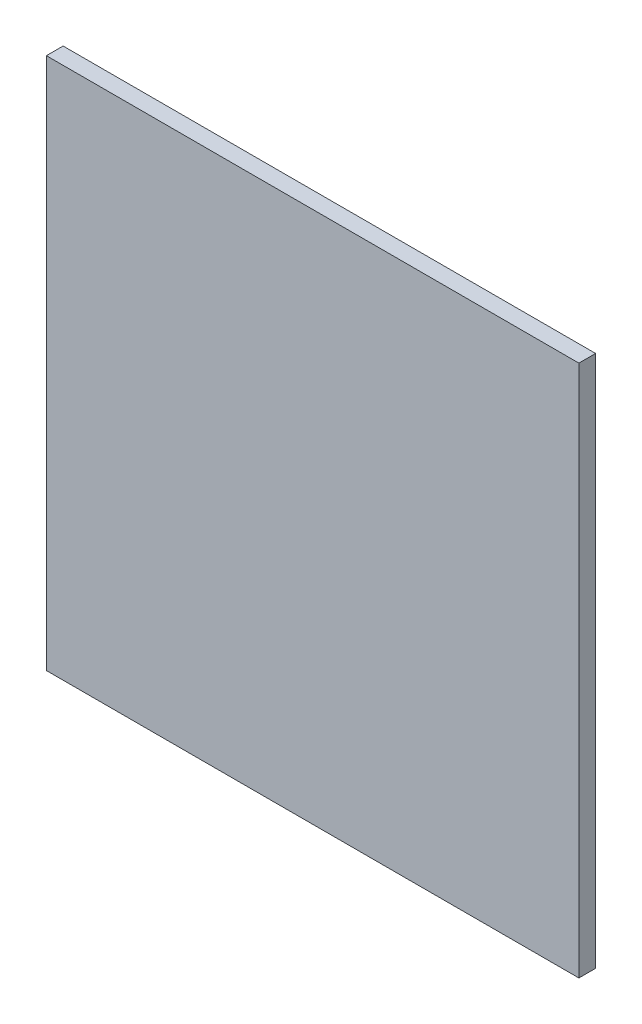
ISO-10303-21;
HEADER;
FILE_DESCRIPTION(('STEP AP214'),'2;1');
FILE_NAME('part.step','',(''),(''),'','','');
FILE_SCHEMA(('AUTOMOTIVE_DESIGN { 1 0 10303 214 1 1 1 1 }'));
ENDSEC;
DATA;
#1=APPLICATION_CONTEXT('core data for automotive mechanical design processes');
#2=APPLICATION_PROTOCOL_DEFINITION('international standard','automotive_design',2000,#1);
#3=PRODUCT_CONTEXT('',#1,'mechanical');
#4=PRODUCT('Part','Part','',(#3));
#5=PRODUCT_RELATED_PRODUCT_CATEGORY('part','',(#4));
#6=PRODUCT_DEFINITION_FORMATION('','',#4);
#7=PRODUCT_DEFINITION_CONTEXT('part definition',#1,'design');
#8=PRODUCT_DEFINITION('design','',#6,#7);
#9=PRODUCT_DEFINITION_SHAPE('','',#8);
#10=(LENGTH_UNIT() NAMED_UNIT(*) SI_UNIT(.MILLI.,.METRE.));
#11=(NAMED_UNIT(*) PLANE_ANGLE_UNIT() SI_UNIT($,.RADIAN.));
#12=(NAMED_UNIT(*) SI_UNIT($,.STERADIAN.) SOLID_ANGLE_UNIT());
#13=UNCERTAINTY_MEASURE_WITH_UNIT(LENGTH_MEASURE(1.E-05),#10,'distance_accuracy_value','');
#14=(GEOMETRIC_REPRESENTATION_CONTEXT(3) GLOBAL_UNCERTAINTY_ASSIGNED_CONTEXT((#13)) GLOBAL_UNIT_ASSIGNED_CONTEXT((#10,
#11,#12)) REPRESENTATION_CONTEXT('',''));
#15=CARTESIAN_POINT('',(0.,0.,0.));
#16=DIRECTION('',(0.,0.,1.));
#17=DIRECTION('',(1.,0.,0.));
#18=AXIS2_PLACEMENT_3D('',#15,#16,#17);
#19=CARTESIAN_POINT('',(17.5,-17.5,1.1));
#20=DIRECTION('',(-1.,0.,0.));
#21=DIRECTION('',(0.,0.,1.));
#22=AXIS2_PLACEMENT_3D('',#19,#20,#21);
#23=PLANE('',#22);
#24=DIRECTION('',(0.,1.,0.));
#25=VECTOR('',#24,1.);
#26=CARTESIAN_POINT('',(17.5,-17.5,0.));
#27=LINE('',#26,#25);
#28=CARTESIAN_POINT('',(17.5,-17.5,0.));
#29=VERTEX_POINT('',#28);
#30=CARTESIAN_POINT('',(17.5,17.5,0.));
#31=VERTEX_POINT('',#30);
#32=EDGE_CURVE('E109',#29,#31,#27,.T.);
#33=ORIENTED_EDGE('',*,*,#32,.T.);
#34=DIRECTION('',(0.,0.,-1.));
#35=VECTOR('',#34,1.);
#36=CARTESIAN_POINT('',(17.5,17.5,1.1));
#37=LINE('',#36,#35);
#38=CARTESIAN_POINT('',(17.5,17.5,1.1));
#39=VERTEX_POINT('',#38);
#40=EDGE_CURVE('E11',#39,#31,#37,.T.);
#41=ORIENTED_EDGE('',*,*,#40,.F.);
#42=DIRECTION('',(0.,1.,0.));
#43=VECTOR('',#42,1.);
#44=CARTESIAN_POINT('',(17.5,-17.5,1.1));
#45=LINE('',#44,#43);
#46=CARTESIAN_POINT('',(17.5,-17.5,1.1));
#47=VERTEX_POINT('',#46);
#48=EDGE_CURVE('E91',#47,#39,#45,.T.);
#49=ORIENTED_EDGE('',*,*,#48,.F.);
#50=DIRECTION('',(0.,0.,-1.));
#51=VECTOR('',#50,1.);
#52=CARTESIAN_POINT('',(17.5,-17.5,1.1));
#53=LINE('',#52,#51);
#54=EDGE_CURVE('E105',#47,#29,#53,.T.);
#55=ORIENTED_EDGE('',*,*,#54,.T.);
#56=EDGE_LOOP('',(#33,#41,#49,#55));
#57=FACE_BOUND('',#56,.T.);
#58=ADVANCED_FACE('F39',(#57),#23,.F.);
#59=CARTESIAN_POINT('',(-17.5,17.5,1.1));
#60=DIRECTION('',(0.,-1.,0.));
#61=DIRECTION('',(0.,0.,-1.));
#62=AXIS2_PLACEMENT_3D('',#59,#60,#61);
#63=PLANE('',#62);
#64=DIRECTION('',(-1.,0.,0.));
#65=VECTOR('',#64,1.);
#66=CARTESIAN_POINT('',(-17.5,17.5,0.));
#67=LINE('',#66,#65);
#68=CARTESIAN_POINT('',(-17.5,17.5,0.));
#69=VERTEX_POINT('',#68);
#70=EDGE_CURVE('E96',#31,#69,#67,.T.);
#71=ORIENTED_EDGE('',*,*,#70,.T.);
#72=DIRECTION('',(0.,0.,-1.));
#73=VECTOR('',#72,1.);
#74=CARTESIAN_POINT('',(-17.5,17.5,1.1));
#75=LINE('',#74,#73);
#76=CARTESIAN_POINT('',(-17.5,17.5,1.1));
#77=VERTEX_POINT('',#76);
#78=EDGE_CURVE('E48',#77,#69,#75,.T.);
#79=ORIENTED_EDGE('',*,*,#78,.F.);
#80=DIRECTION('',(-1.,0.,0.));
#81=VECTOR('',#80,1.);
#82=CARTESIAN_POINT('',(-17.5,17.5,1.1));
#83=LINE('',#82,#81);
#84=EDGE_CURVE('E86',#39,#77,#83,.T.);
#85=ORIENTED_EDGE('',*,*,#84,.F.);
#86=ORIENTED_EDGE('',*,*,#40,.T.);
#87=EDGE_LOOP('',(#71,#79,#85,#86));
#88=FACE_BOUND('',#87,.T.);
#89=ADVANCED_FACE('F95',(#88),#63,.F.);
#90=CARTESIAN_POINT('',(-17.5,-17.5,1.1));
#91=DIRECTION('',(1.,0.,0.));
#92=DIRECTION('',(0.,0.,-1.));
#93=AXIS2_PLACEMENT_3D('',#90,#91,#92);
#94=PLANE('',#93);
#95=DIRECTION('',(0.,-1.,0.));
#96=VECTOR('',#95,1.);
#97=CARTESIAN_POINT('',(-17.5,-17.5,0.));
#98=LINE('',#97,#96);
#99=CARTESIAN_POINT('',(-17.5,-17.5,0.));
#100=VERTEX_POINT('',#99);
#101=EDGE_CURVE('E73',#69,#100,#98,.T.);
#102=ORIENTED_EDGE('',*,*,#101,.T.);
#103=DIRECTION('',(0.,0.,-1.));
#104=VECTOR('',#103,1.);
#105=CARTESIAN_POINT('',(-17.5,-17.5,1.1));
#106=LINE('',#105,#104);
#107=CARTESIAN_POINT('',(-17.5,-17.5,1.1));
#108=VERTEX_POINT('',#107);
#109=EDGE_CURVE('E98',#108,#100,#106,.T.);
#110=ORIENTED_EDGE('',*,*,#109,.F.);
#111=DIRECTION('',(0.,-1.,0.));
#112=VECTOR('',#111,1.);
#113=CARTESIAN_POINT('',(-17.5,-17.5,1.1));
#114=LINE('',#113,#112);
#115=EDGE_CURVE('E89',#77,#108,#114,.T.);
#116=ORIENTED_EDGE('',*,*,#115,.F.);
#117=ORIENTED_EDGE('',*,*,#78,.T.);
#118=EDGE_LOOP('',(#102,#110,#116,#117));
#119=FACE_BOUND('',#118,.T.);
#120=ADVANCED_FACE('F99',(#119),#94,.F.);
#121=CARTESIAN_POINT('',(-17.5,-17.5,1.1));
#122=DIRECTION('',(0.,1.,0.));
#123=DIRECTION('',(0.,0.,1.));
#124=AXIS2_PLACEMENT_3D('',#121,#122,#123);
#125=PLANE('',#124);
#126=DIRECTION('',(1.,0.,0.));
#127=VECTOR('',#126,1.);
#128=CARTESIAN_POINT('',(-17.5,-17.5,0.));
#129=LINE('',#128,#127);
#130=EDGE_CURVE('E79',#100,#29,#129,.T.);
#131=ORIENTED_EDGE('',*,*,#130,.T.);
#132=ORIENTED_EDGE('',*,*,#54,.F.);
#133=DIRECTION('',(1.,0.,0.));
#134=VECTOR('',#133,1.);
#135=CARTESIAN_POINT('',(-17.5,-17.5,1.1));
#136=LINE('',#135,#134);
#137=EDGE_CURVE('E56',#108,#47,#136,.T.);
#138=ORIENTED_EDGE('',*,*,#137,.F.);
#139=ORIENTED_EDGE('',*,*,#109,.T.);
#140=EDGE_LOOP('',(#131,#132,#138,#139));
#141=FACE_BOUND('',#140,.T.);
#142=ADVANCED_FACE('F121',(#141),#125,.F.);
#143=CARTESIAN_POINT('',(0.,0.,1.1));
#144=DIRECTION('',(0.,0.,-1.));
#145=DIRECTION('',(-1.,0.,0.));
#146=AXIS2_PLACEMENT_3D('',#143,#144,#145);
#147=PLANE('',#146);
#148=ORIENTED_EDGE('',*,*,#48,.T.);
#149=ORIENTED_EDGE('',*,*,#84,.T.);
#150=ORIENTED_EDGE('',*,*,#115,.T.);
#151=ORIENTED_EDGE('',*,*,#137,.T.);
#152=EDGE_LOOP('',(#148,#149,#150,#151));
#153=FACE_BOUND('',#152,.T.);
#154=ADVANCED_FACE('F87',(#153),#147,.F.);
#155=CARTESIAN_POINT('',(0.,0.,0.));
#156=DIRECTION('',(0.,0.,-1.));
#157=DIRECTION('',(-1.,0.,0.));
#158=AXIS2_PLACEMENT_3D('',#155,#156,#157);
#159=PLANE('',#158);
#160=ORIENTED_EDGE('',*,*,#32,.F.);
#161=ORIENTED_EDGE('',*,*,#130,.F.);
#162=ORIENTED_EDGE('',*,*,#101,.F.);
#163=ORIENTED_EDGE('',*,*,#70,.F.);
#164=EDGE_LOOP('',(#160,#161,#162,#163));
#165=FACE_BOUND('',#164,.T.);
#166=ADVANCED_FACE('F124',(#165),#159,.T.);
#167=CLOSED_SHELL('',(#58,#89,#120,#142,#154,#166));
#168=MANIFOLD_SOLID_BREP('B2',#167);
#169=ADVANCED_BREP_SHAPE_REPRESENTATION('',(#18,#168),#14);
#170=SHAPE_DEFINITION_REPRESENTATION(#9,#169);
ENDSEC;
END-ISO-10303-21;
